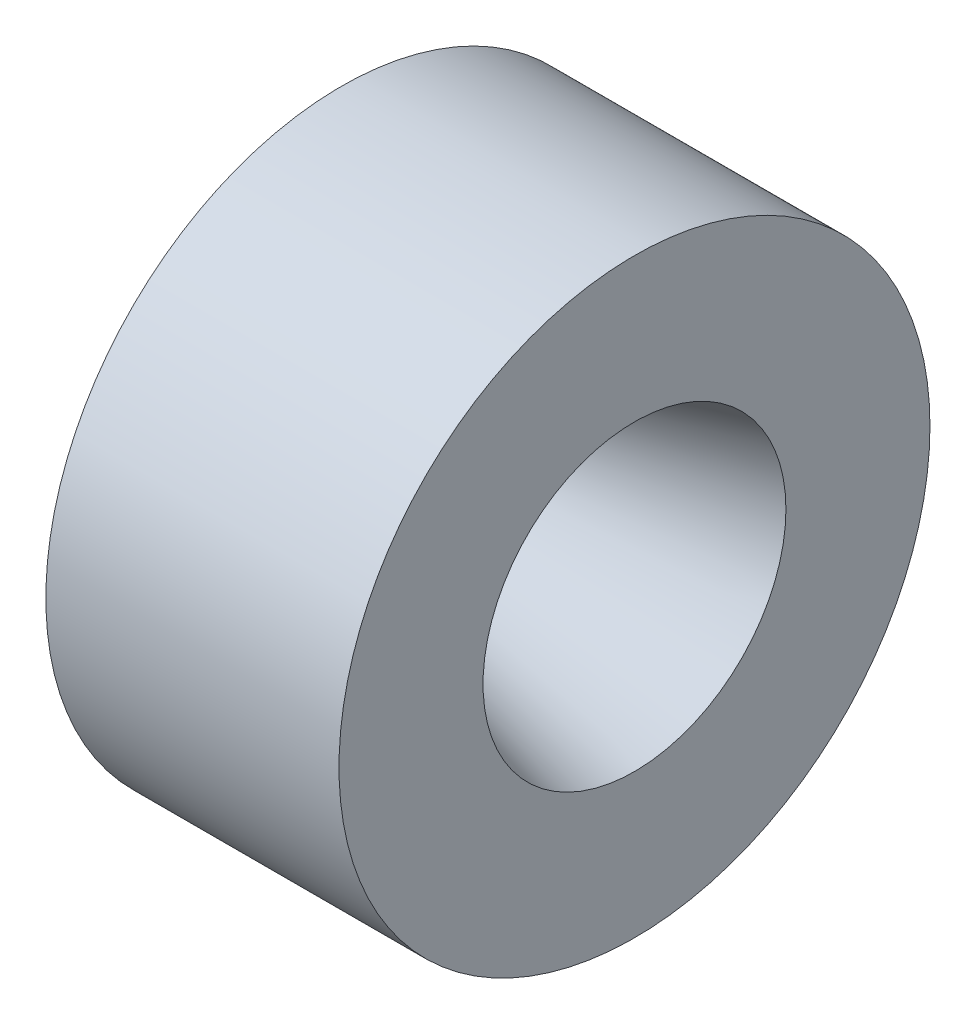
ISO-10303-21;
HEADER;
FILE_DESCRIPTION(('STEP AP214'),'2;1');
FILE_NAME('part.step','',(''),(''),'','','');
FILE_SCHEMA(('AUTOMOTIVE_DESIGN { 1 0 10303 214 1 1 1 1 }'));
ENDSEC;
DATA;
#1=APPLICATION_CONTEXT('core data for automotive mechanical design processes');
#2=APPLICATION_PROTOCOL_DEFINITION('international standard','automotive_design',2000,#1);
#3=PRODUCT_CONTEXT('',#1,'mechanical');
#4=PRODUCT('Part','Part','',(#3));
#5=PRODUCT_RELATED_PRODUCT_CATEGORY('part','',(#4));
#6=PRODUCT_DEFINITION_FORMATION('','',#4);
#7=PRODUCT_DEFINITION_CONTEXT('part definition',#1,'design');
#8=PRODUCT_DEFINITION('design','',#6,#7);
#9=PRODUCT_DEFINITION_SHAPE('','',#8);
#10=(LENGTH_UNIT() NAMED_UNIT(*) SI_UNIT(.MILLI.,.METRE.));
#11=(NAMED_UNIT(*) PLANE_ANGLE_UNIT() SI_UNIT($,.RADIAN.));
#12=(NAMED_UNIT(*) SI_UNIT($,.STERADIAN.) SOLID_ANGLE_UNIT());
#13=UNCERTAINTY_MEASURE_WITH_UNIT(LENGTH_MEASURE(1.E-05),#10,'distance_accuracy_value','');
#14=(GEOMETRIC_REPRESENTATION_CONTEXT(3) GLOBAL_UNCERTAINTY_ASSIGNED_CONTEXT((#13)) GLOBAL_UNIT_ASSIGNED_CONTEXT((#10,
#11,#12)) REPRESENTATION_CONTEXT('',''));
#15=CARTESIAN_POINT('',(0.,0.,0.));
#16=DIRECTION('',(0.,0.,1.));
#17=DIRECTION('',(1.,0.,0.));
#18=AXIS2_PLACEMENT_3D('',#15,#16,#17);
#19=CARTESIAN_POINT('',(152.7302,0.,0.));
#20=DIRECTION('',(1.,0.,0.));
#21=DIRECTION('',(0.,0.,-1.));
#22=AXIS2_PLACEMENT_3D('',#19,#20,#21);
#23=CYLINDRICAL_SURFACE('',#22,50.546);
#24=CARTESIAN_POINT('',(154.3304,0.,0.));
#25=DIRECTION('',(1.,0.,0.));
#26=DIRECTION('',(0.,0.,-1.));
#27=AXIS2_PLACEMENT_3D('',#24,#25,#26);
#28=CIRCLE('',#27,50.546);
#29=CARTESIAN_POINT('',(154.3304,0.,-50.546));
#30=VERTEX_POINT('',#29);
#31=EDGE_CURVE('E62',#30,#30,#28,.T.);
#32=ORIENTED_EDGE('',*,*,#31,.T.);
#33=EDGE_LOOP('',(#32));
#34=FACE_BOUND('',#33,.T.);
#35=CARTESIAN_POINT('',(204.475298590178,0.,0.));
#36=DIRECTION('',(1.,0.,0.));
#37=DIRECTION('',(0.,0.,-1.));
#38=AXIS2_PLACEMENT_3D('',#35,#36,#37);
#39=CIRCLE('',#38,50.546);
#40=CARTESIAN_POINT('',(204.475298590178,0.,-50.546));
#41=VERTEX_POINT('',#40);
#42=EDGE_CURVE('E74',#41,#41,#39,.T.);
#43=ORIENTED_EDGE('',*,*,#42,.F.);
#44=EDGE_LOOP('',(#43));
#45=FACE_BOUND('',#44,.T.);
#46=ADVANCED_FACE('F36',(#34,#45),#23,.T.);
#47=CARTESIAN_POINT('',(154.3304,50.546,0.));
#48=DIRECTION('',(-1.,0.,0.));
#49=DIRECTION('',(0.,0.,1.));
#50=AXIS2_PLACEMENT_3D('',#47,#48,#49);
#51=PLANE('',#50);
#52=CARTESIAN_POINT('',(154.3304,0.,0.));
#53=DIRECTION('',(-1.,0.,0.));
#54=DIRECTION('',(0.,0.,1.));
#55=AXIS2_PLACEMENT_3D('',#52,#53,#54);
#56=CIRCLE('',#55,44.069);
#57=CARTESIAN_POINT('',(154.3304,0.,44.069));
#58=VERTEX_POINT('',#57);
#59=EDGE_CURVE('E59',#58,#58,#56,.F.);
#60=ORIENTED_EDGE('',*,*,#59,.T.);
#61=EDGE_LOOP('',(#60));
#62=FACE_BOUND('',#61,.T.);
#63=ORIENTED_EDGE('',*,*,#31,.F.);
#64=EDGE_LOOP('',(#63));
#65=FACE_BOUND('',#64,.T.);
#66=ADVANCED_FACE('F82',(#62,#65),#51,.T.);
#67=CARTESIAN_POINT('',(152.7302,0.,0.));
#68=DIRECTION('',(1.,0.,0.));
#69=DIRECTION('',(0.,0.,-1.));
#70=AXIS2_PLACEMENT_3D('',#67,#68,#69);
#71=CYLINDRICAL_SURFACE('',#70,43.815);
#72=CARTESIAN_POINT('',(154.0764,0.,0.));
#73=DIRECTION('',(-1.,0.,0.));
#74=DIRECTION('',(0.,0.,1.));
#75=AXIS2_PLACEMENT_3D('',#72,#73,#74);
#76=CIRCLE('',#75,43.815);
#77=CARTESIAN_POINT('',(154.0764,0.,43.815));
#78=VERTEX_POINT('',#77);
#79=EDGE_CURVE('E56',#78,#78,#76,.T.);
#80=ORIENTED_EDGE('',*,*,#79,.T.);
#81=EDGE_LOOP('',(#80));
#82=FACE_BOUND('',#81,.T.);
#83=CARTESIAN_POINT('',(151.7904,0.,0.));
#84=DIRECTION('',(1.,0.,0.));
#85=DIRECTION('',(0.,0.,-1.));
#86=AXIS2_PLACEMENT_3D('',#83,#84,#85);
#87=CIRCLE('',#86,43.815);
#88=CARTESIAN_POINT('',(151.7904,0.,-43.815));
#89=VERTEX_POINT('',#88);
#90=EDGE_CURVE('E65',#89,#89,#87,.T.);
#91=ORIENTED_EDGE('',*,*,#90,.T.);
#92=EDGE_LOOP('',(#91));
#93=FACE_BOUND('',#92,.T.);
#94=ADVANCED_FACE('F88',(#82,#93),#71,.T.);
#95=CARTESIAN_POINT('',(151.7904,43.815,0.));
#96=DIRECTION('',(-1.,0.,0.));
#97=DIRECTION('',(0.,0.,1.));
#98=AXIS2_PLACEMENT_3D('',#95,#96,#97);
#99=PLANE('',#98);
#100=CARTESIAN_POINT('',(151.7904,0.,0.));
#101=DIRECTION('',(1.,0.,0.));
#102=DIRECTION('',(0.,0.,-1.));
#103=AXIS2_PLACEMENT_3D('',#100,#101,#102);
#104=CIRCLE('',#103,40.767);
#105=CARTESIAN_POINT('',(151.7904,0.,-40.767));
#106=VERTEX_POINT('',#105);
#107=EDGE_CURVE('E68',#106,#106,#104,.T.);
#108=ORIENTED_EDGE('',*,*,#107,.T.);
#109=EDGE_LOOP('',(#108));
#110=FACE_BOUND('',#109,.T.);
#111=ORIENTED_EDGE('',*,*,#90,.F.);
#112=EDGE_LOOP('',(#111));
#113=FACE_BOUND('',#112,.T.);
#114=ADVANCED_FACE('F118',(#110,#113),#99,.T.);
#115=CARTESIAN_POINT('',(152.7302,0.,0.));
#116=DIRECTION('',(1.,0.,0.));
#117=DIRECTION('',(0.,0.,-1.));
#118=AXIS2_PLACEMENT_3D('',#115,#116,#117);
#119=CYLINDRICAL_SURFACE('',#118,40.767);
#120=CARTESIAN_POINT('',(153.008159691599,0.,0.));
#121=DIRECTION('',(1.,0.,0.));
#122=DIRECTION('',(0.,0.,-1.));
#123=AXIS2_PLACEMENT_3D('',#120,#121,#122);
#124=CIRCLE('',#123,40.767);
#125=CARTESIAN_POINT('',(153.008159691599,0.,-40.767));
#126=VERTEX_POINT('',#125);
#127=EDGE_CURVE('E43',#126,#126,#124,.T.);
#128=ORIENTED_EDGE('',*,*,#127,.T.);
#129=EDGE_LOOP('',(#128));
#130=FACE_BOUND('',#129,.T.);
#131=ORIENTED_EDGE('',*,*,#107,.F.);
#132=EDGE_LOOP('',(#131));
#133=FACE_BOUND('',#132,.T.);
#134=ADVANCED_FACE('F110',(#130,#133),#119,.F.);
#135=CARTESIAN_POINT('',(154.3304,0.,0.));
#136=DIRECTION('',(-1.,0.,0.));
#137=DIRECTION('',(0.,0.,1.));
#138=AXIS2_PLACEMENT_3D('',#135,#136,#137);
#139=CONICAL_SURFACE('',#138,40.767,0.959931088596883);
#140=CARTESIAN_POINT('',(155.088805884093,0.,0.));
#141=DIRECTION('',(-1.,0.,0.));
#142=DIRECTION('',(0.,0.,1.));
#143=AXIS2_PLACEMENT_3D('',#140,#141,#142);
#144=CIRCLE('',#143,39.6838841483317);
#145=CARTESIAN_POINT('',(155.088805884093,0.,39.6838841483317));
#146=VERTEX_POINT('',#145);
#147=EDGE_CURVE('E10',#146,#146,#144,.T.);
#148=ORIENTED_EDGE('',*,*,#147,.T.);
#149=EDGE_LOOP('',(#148));
#150=FACE_BOUND('',#149,.T.);
#151=CARTESIAN_POINT('',(170.502924007874,0.,0.));
#152=DIRECTION('',(1.,0.,0.));
#153=DIRECTION('',(0.,0.,-1.));
#154=AXIS2_PLACEMENT_3D('',#151,#152,#153);
#155=CIRCLE('',#154,17.6702420741658);
#156=CARTESIAN_POINT('',(170.502924007874,0.,-17.6702420741658));
#157=VERTEX_POINT('',#156);
#158=EDGE_CURVE('E51',#157,#157,#155,.T.);
#159=ORIENTED_EDGE('',*,*,#158,.T.);
#160=EDGE_LOOP('',(#159));
#161=FACE_BOUND('',#160,.T.);
#162=ADVANCED_FACE('F107',(#150,#161),#139,.F.);
#163=CARTESIAN_POINT('',(171.012984639354,0.,0.));
#164=DIRECTION('',(1.,0.,0.));
#165=DIRECTION('',(0.,0.,-1.));
#166=AXIS2_PLACEMENT_3D('',#163,#164,#165);
#167=CONICAL_SURFACE('',#166,16.9418,0.26179938779915);
#168=CARTESIAN_POINT('',(171.871947291401,0.,0.));
#169=DIRECTION('',(-1.,0.,0.));
#170=DIRECTION('',(0.,0.,1.));
#171=AXIS2_PLACEMENT_3D('',#168,#169,#170);
#172=CIRCLE('',#171,17.1719583489445);
#173=CARTESIAN_POINT('',(171.871947291401,0.,17.1719583489445));
#174=VERTEX_POINT('',#173);
#175=EDGE_CURVE('E47',#174,#174,#172,.T.);
#176=ORIENTED_EDGE('',*,*,#175,.T.);
#177=EDGE_LOOP('',(#176));
#178=FACE_BOUND('',#177,.T.);
#179=CARTESIAN_POINT('',(204.475298590178,0.,0.));
#180=DIRECTION('',(1.,0.,0.));
#181=DIRECTION('',(0.,0.,-1.));
#182=AXIS2_PLACEMENT_3D('',#179,#180,#181);
#183=CIRCLE('',#182,25.908);
#184=CARTESIAN_POINT('',(204.475298590178,0.,-25.908));
#185=VERTEX_POINT('',#184);
#186=EDGE_CURVE('E71',#185,#185,#183,.T.);
#187=ORIENTED_EDGE('',*,*,#186,.T.);
#188=EDGE_LOOP('',(#187));
#189=FACE_BOUND('',#188,.T.);
#190=ADVANCED_FACE('F109',(#178,#189),#167,.F.);
#191=CARTESIAN_POINT('',(204.475298590178,25.908,0.));
#192=DIRECTION('',(1.,0.,0.));
#193=DIRECTION('',(0.,0.,-1.));
#194=AXIS2_PLACEMENT_3D('',#191,#192,#193);
#195=PLANE('',#194);
#196=ORIENTED_EDGE('',*,*,#42,.T.);
#197=EDGE_LOOP('',(#196));
#198=FACE_BOUND('',#197,.T.);
#199=ORIENTED_EDGE('',*,*,#186,.F.);
#200=EDGE_LOOP('',(#199));
#201=FACE_BOUND('',#200,.T.);
#202=ADVANCED_FACE('F78',(#198,#201),#195,.T.);
#203=CARTESIAN_POINT('',(154.0764,0.,0.));
#204=DIRECTION('',(-1.,0.,0.));
#205=DIRECTION('',(0.,0.,1.));
#206=AXIS2_PLACEMENT_3D('',#203,#204,#205);
#207=TOROIDAL_SURFACE('',#206,44.069,0.254);
#208=ORIENTED_EDGE('',*,*,#79,.F.);
#209=EDGE_LOOP('',(#208));
#210=FACE_BOUND('',#209,.T.);
#211=ORIENTED_EDGE('',*,*,#59,.F.);
#212=EDGE_LOOP('',(#211));
#213=FACE_BOUND('',#212,.T.);
#214=ADVANCED_FACE('F93',(#210,#213),#207,.F.);
#215=CARTESIAN_POINT('',(171.543247104121,0.,0.));
#216=DIRECTION('',(-1.,0.,0.));
#217=DIRECTION('',(0.,0.,1.));
#218=AXIS2_PLACEMENT_3D('',#215,#216,#217);
#219=TOROIDAL_SURFACE('',#218,18.3986841483317,1.27);
#220=ORIENTED_EDGE('',*,*,#175,.F.);
#221=EDGE_LOOP('',(#220));
#222=FACE_BOUND('',#221,.T.);
#223=ORIENTED_EDGE('',*,*,#158,.F.);
#224=EDGE_LOOP('',(#223));
#225=FACE_BOUND('',#224,.T.);
#226=ADVANCED_FACE('F95',(#222,#225),#219,.T.);
#227=CARTESIAN_POINT('',(153.008159691599,0.,0.));
#228=DIRECTION('',(1.,0.,0.));
#229=DIRECTION('',(0.,0.,-1.));
#230=AXIS2_PLACEMENT_3D('',#227,#228,#229);
#231=TOROIDAL_SURFACE('',#230,38.227,2.54);
#232=ORIENTED_EDGE('',*,*,#147,.F.);
#233=EDGE_LOOP('',(#232));
#234=FACE_BOUND('',#233,.T.);
#235=ORIENTED_EDGE('',*,*,#127,.F.);
#236=EDGE_LOOP('',(#235));
#237=FACE_BOUND('',#236,.T.);
#238=ADVANCED_FACE('F38',(#234,#237),#231,.F.);
#239=CLOSED_SHELL('',(#46,#66,#94,#114,#134,#162,#190,#202,#214,#226,#238));
#240=MANIFOLD_SOLID_BREP('B2',#239);
#241=ADVANCED_BREP_SHAPE_REPRESENTATION('',(#18,#240),#14);
#242=SHAPE_DEFINITION_REPRESENTATION(#9,#241);
ENDSEC;
END-ISO-10303-21;
